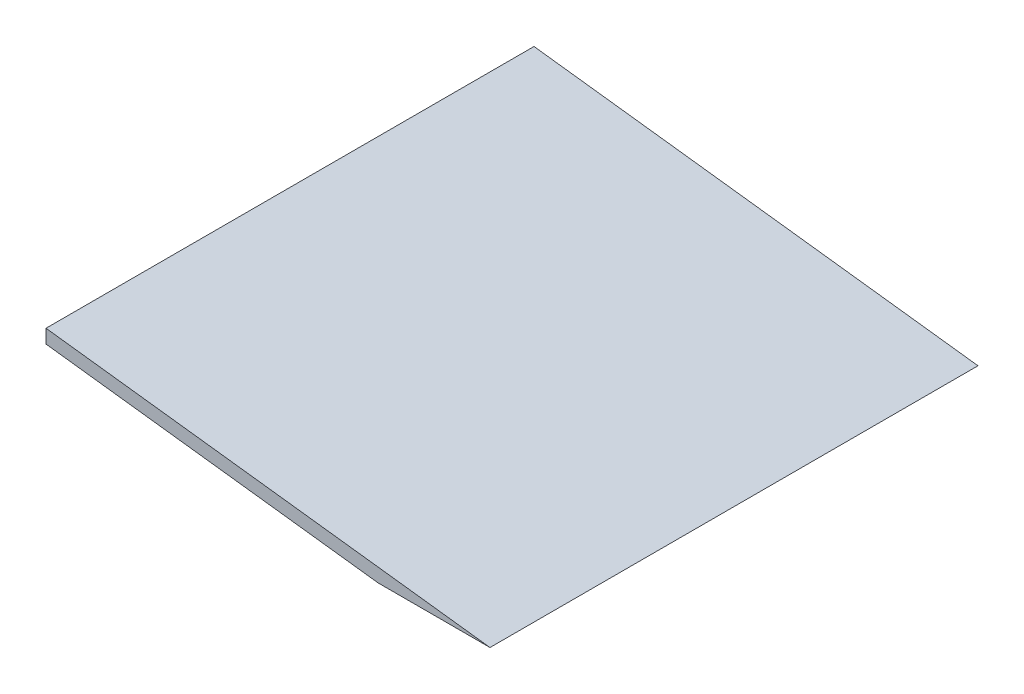
ISO-10303-21;
HEADER;
FILE_DESCRIPTION(('STEP AP214'),'2;1');
FILE_NAME('part.step','',(''),(''),'','','');
FILE_SCHEMA(('AUTOMOTIVE_DESIGN { 1 0 10303 214 1 1 1 1 }'));
ENDSEC;
DATA;
#1=APPLICATION_CONTEXT('core data for automotive mechanical design processes');
#2=APPLICATION_PROTOCOL_DEFINITION('international standard','automotive_design',2000,#1);
#3=PRODUCT_CONTEXT('',#1,'mechanical');
#4=PRODUCT('Part','Part','',(#3));
#5=PRODUCT_RELATED_PRODUCT_CATEGORY('part','',(#4));
#6=PRODUCT_DEFINITION_FORMATION('','',#4);
#7=PRODUCT_DEFINITION_CONTEXT('part definition',#1,'design');
#8=PRODUCT_DEFINITION('design','',#6,#7);
#9=PRODUCT_DEFINITION_SHAPE('','',#8);
#10=(LENGTH_UNIT() NAMED_UNIT(*) SI_UNIT(.MILLI.,.METRE.));
#11=(NAMED_UNIT(*) PLANE_ANGLE_UNIT() SI_UNIT($,.RADIAN.));
#12=(NAMED_UNIT(*) SI_UNIT($,.STERADIAN.) SOLID_ANGLE_UNIT());
#13=UNCERTAINTY_MEASURE_WITH_UNIT(LENGTH_MEASURE(1.E-05),#10,'distance_accuracy_value','');
#14=(GEOMETRIC_REPRESENTATION_CONTEXT(3) GLOBAL_UNCERTAINTY_ASSIGNED_CONTEXT((#13)) GLOBAL_UNIT_ASSIGNED_CONTEXT((#10,
#11,#12)) REPRESENTATION_CONTEXT('',''));
#15=CARTESIAN_POINT('',(0.,0.,0.));
#16=DIRECTION('',(0.,0.,1.));
#17=DIRECTION('',(1.,0.,0.));
#18=AXIS2_PLACEMENT_3D('',#15,#16,#17);
#19=CARTESIAN_POINT('',(0.,-3.19884369583184,113.6904));
#20=DIRECTION('',(1.,0.,0.));
#21=DIRECTION('',(0.,0.,-1.));
#22=AXIS2_PLACEMENT_3D('',#19,#20,#21);
#23=PLANE('',#22);
#24=DIRECTION('',(0.,-1.,0.));
#25=VECTOR('',#24,1.);
#26=CARTESIAN_POINT('',(0.,-3.19884369583184,0.));
#27=LINE('',#26,#25);
#28=CARTESIAN_POINT('',(0.,0.,0.));
#29=VERTEX_POINT('',#28);
#30=CARTESIAN_POINT('',(0.,-3.19884369583184,0.));
#31=VERTEX_POINT('',#30);
#32=EDGE_CURVE('E107',#29,#31,#27,.T.);
#33=ORIENTED_EDGE('',*,*,#32,.T.);
#34=DIRECTION('',(0.,0.,-1.));
#35=VECTOR('',#34,1.);
#36=CARTESIAN_POINT('',(0.,-3.19884369583184,113.6904));
#37=LINE('',#36,#35);
#38=CARTESIAN_POINT('',(0.,-3.19884369583184,113.6904));
#39=VERTEX_POINT('',#38);
#40=EDGE_CURVE('E11',#39,#31,#37,.T.);
#41=ORIENTED_EDGE('',*,*,#40,.F.);
#42=DIRECTION('',(0.,-1.,0.));
#43=VECTOR('',#42,1.);
#44=CARTESIAN_POINT('',(0.,-3.19884369583184,113.6904));
#45=LINE('',#44,#43);
#46=CARTESIAN_POINT('',(0.,0.,113.6904));
#47=VERTEX_POINT('',#46);
#48=EDGE_CURVE('E91',#47,#39,#45,.T.);
#49=ORIENTED_EDGE('',*,*,#48,.F.);
#50=DIRECTION('',(0.,0.,-1.));
#51=VECTOR('',#50,1.);
#52=CARTESIAN_POINT('',(0.,0.,113.6904));
#53=LINE('',#52,#51);
#54=EDGE_CURVE('E103',#47,#29,#53,.T.);
#55=ORIENTED_EDGE('',*,*,#54,.T.);
#56=EDGE_LOOP('',(#33,#41,#49,#55));
#57=FACE_BOUND('',#56,.T.);
#58=ADVANCED_FACE('F39',(#57),#23,.F.);
#59=CARTESIAN_POINT('',(77.3807084074848,-12.7,113.6904));
#60=DIRECTION('',(0.12186934340514,0.992546151641323,0.));
#61=DIRECTION('',(-0.992546151641323,0.12186934340514,0.));
#62=AXIS2_PLACEMENT_3D('',#59,#60,#61);
#63=PLANE('',#62);
#64=DIRECTION('',(0.992546151641323,-0.12186934340514,0.));
#65=VECTOR('',#64,1.);
#66=CARTESIAN_POINT('',(77.3807084074848,-12.7,0.));
#67=LINE('',#66,#65);
#68=CARTESIAN_POINT('',(77.3807084074848,-12.7,0.));
#69=VERTEX_POINT('',#68);
#70=EDGE_CURVE('E96',#31,#69,#67,.T.);
#71=ORIENTED_EDGE('',*,*,#70,.T.);
#72=DIRECTION('',(0.,0.,-1.));
#73=VECTOR('',#72,1.);
#74=CARTESIAN_POINT('',(77.3807084074848,-12.7,113.6904));
#75=LINE('',#74,#73);
#76=CARTESIAN_POINT('',(77.3807084074848,-12.7,113.6904));
#77=VERTEX_POINT('',#76);
#78=EDGE_CURVE('E48',#77,#69,#75,.T.);
#79=ORIENTED_EDGE('',*,*,#78,.F.);
#80=DIRECTION('',(0.992546151641323,-0.12186934340514,0.));
#81=VECTOR('',#80,1.);
#82=CARTESIAN_POINT('',(77.3807084074848,-12.7,113.6904));
#83=LINE('',#82,#81);
#84=EDGE_CURVE('E86',#39,#77,#83,.T.);
#85=ORIENTED_EDGE('',*,*,#84,.F.);
#86=ORIENTED_EDGE('',*,*,#40,.T.);
#87=EDGE_LOOP('',(#71,#79,#85,#86));
#88=FACE_BOUND('',#87,.T.);
#89=ADVANCED_FACE('F95',(#88),#63,.F.);
#90=CARTESIAN_POINT('',(103.433199635283,-12.7,113.6904));
#91=DIRECTION('',(0.,1.,0.));
#92=DIRECTION('',(-1.,0.,0.));
#93=AXIS2_PLACEMENT_3D('',#90,#91,#92);
#94=PLANE('',#93);
#95=DIRECTION('',(1.,0.,0.));
#96=VECTOR('',#95,1.);
#97=CARTESIAN_POINT('',(103.433199635283,-12.7,0.));
#98=LINE('',#97,#96);
#99=CARTESIAN_POINT('',(103.433199635283,-12.7,0.));
#100=VERTEX_POINT('',#99);
#101=EDGE_CURVE('E73',#69,#100,#98,.T.);
#102=ORIENTED_EDGE('',*,*,#101,.T.);
#103=DIRECTION('',(0.,0.,-1.));
#104=VECTOR('',#103,1.);
#105=CARTESIAN_POINT('',(103.433199635283,-12.7,113.6904));
#106=LINE('',#105,#104);
#107=CARTESIAN_POINT('',(103.433199635283,-12.7,113.6904));
#108=VERTEX_POINT('',#107);
#109=EDGE_CURVE('E98',#108,#100,#106,.T.);
#110=ORIENTED_EDGE('',*,*,#109,.F.);
#111=DIRECTION('',(1.,0.,0.));
#112=VECTOR('',#111,1.);
#113=CARTESIAN_POINT('',(103.433199635283,-12.7,113.6904));
#114=LINE('',#113,#112);
#115=EDGE_CURVE('E89',#77,#108,#114,.T.);
#116=ORIENTED_EDGE('',*,*,#115,.F.);
#117=ORIENTED_EDGE('',*,*,#78,.T.);
#118=EDGE_LOOP('',(#102,#110,#116,#117));
#119=FACE_BOUND('',#118,.T.);
#120=ADVANCED_FACE('F99',(#119),#94,.F.);
#121=CARTESIAN_POINT('',(0.,0.,113.6904));
#122=DIRECTION('',(-0.12186934340514,-0.992546151641323,0.));
#123=DIRECTION('',(0.992546151641323,-0.12186934340514,0.));
#124=AXIS2_PLACEMENT_3D('',#121,#122,#123);
#125=PLANE('',#124);
#126=DIRECTION('',(-0.992546151641323,0.12186934340514,0.));
#127=VECTOR('',#126,1.);
#128=CARTESIAN_POINT('',(0.,0.,0.));
#129=LINE('',#128,#127);
#130=EDGE_CURVE('E79',#100,#29,#129,.T.);
#131=ORIENTED_EDGE('',*,*,#130,.T.);
#132=ORIENTED_EDGE('',*,*,#54,.F.);
#133=DIRECTION('',(-0.992546151641323,0.12186934340514,0.));
#134=VECTOR('',#133,1.);
#135=CARTESIAN_POINT('',(0.,0.,113.6904));
#136=LINE('',#135,#134);
#137=EDGE_CURVE('E56',#108,#47,#136,.T.);
#138=ORIENTED_EDGE('',*,*,#137,.F.);
#139=ORIENTED_EDGE('',*,*,#109,.T.);
#140=EDGE_LOOP('',(#131,#132,#138,#139));
#141=FACE_BOUND('',#140,.T.);
#142=ADVANCED_FACE('F120',(#141),#125,.F.);
#143=CARTESIAN_POINT('',(0.,0.,113.6904));
#144=DIRECTION('',(0.,0.,1.));
#145=DIRECTION('',(1.,0.,0.));
#146=AXIS2_PLACEMENT_3D('',#143,#144,#145);
#147=PLANE('',#146);
#148=ORIENTED_EDGE('',*,*,#48,.T.);
#149=ORIENTED_EDGE('',*,*,#84,.T.);
#150=ORIENTED_EDGE('',*,*,#115,.T.);
#151=ORIENTED_EDGE('',*,*,#137,.T.);
#152=EDGE_LOOP('',(#148,#149,#150,#151));
#153=FACE_BOUND('',#152,.T.);
#154=ADVANCED_FACE('F87',(#153),#147,.T.);
#155=CARTESIAN_POINT('',(0.,0.,0.));
#156=DIRECTION('',(0.,0.,1.));
#157=DIRECTION('',(1.,0.,0.));
#158=AXIS2_PLACEMENT_3D('',#155,#156,#157);
#159=PLANE('',#158);
#160=ORIENTED_EDGE('',*,*,#32,.F.);
#161=ORIENTED_EDGE('',*,*,#130,.F.);
#162=ORIENTED_EDGE('',*,*,#101,.F.);
#163=ORIENTED_EDGE('',*,*,#70,.F.);
#164=EDGE_LOOP('',(#160,#161,#162,#163));
#165=FACE_BOUND('',#164,.T.);
#166=ADVANCED_FACE('F123',(#165),#159,.F.);
#167=CLOSED_SHELL('',(#58,#89,#120,#142,#154,#166));
#168=MANIFOLD_SOLID_BREP('B2',#167);
#169=ADVANCED_BREP_SHAPE_REPRESENTATION('',(#18,#168),#14);
#170=SHAPE_DEFINITION_REPRESENTATION(#9,#169);
ENDSEC;
END-ISO-10303-21;
